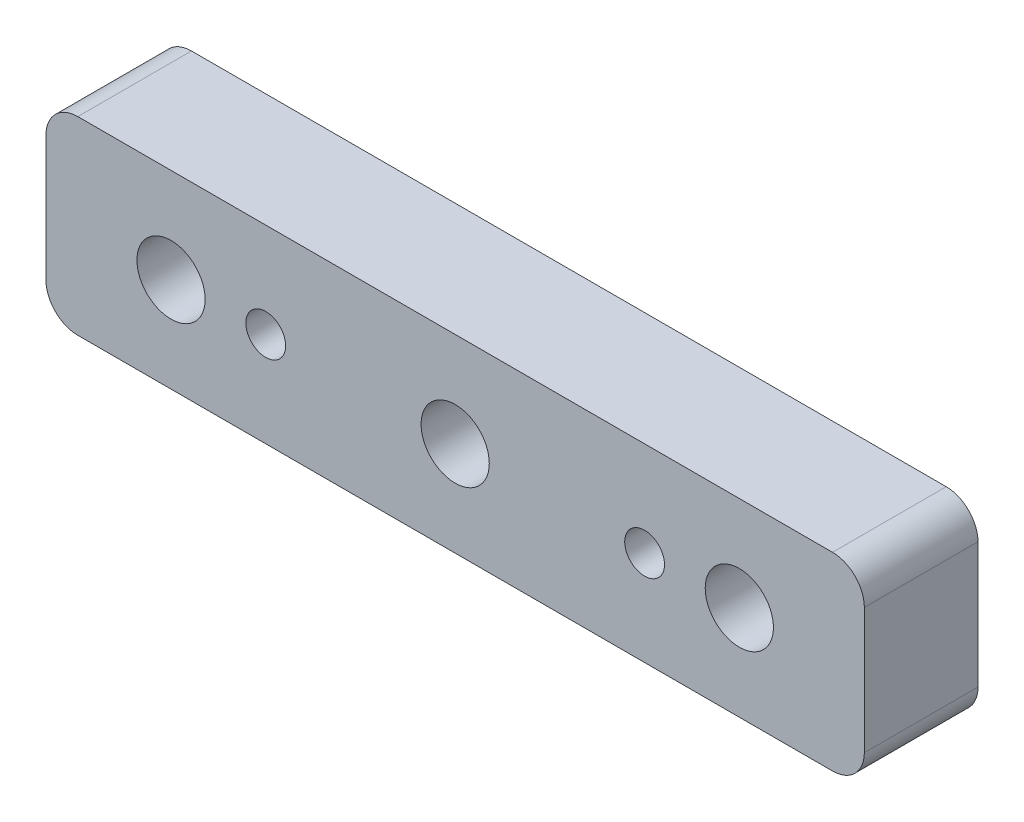
ISO-10303-21;
HEADER;
FILE_DESCRIPTION(('STEP AP214'),'2;1');
FILE_NAME('part.step','',(''),(''),'','','');
FILE_SCHEMA(('AUTOMOTIVE_DESIGN { 1 0 10303 214 1 1 1 1 }'));
ENDSEC;
DATA;
#1=APPLICATION_CONTEXT('core data for automotive mechanical design processes');
#2=APPLICATION_PROTOCOL_DEFINITION('international standard','automotive_design',2000,#1);
#3=PRODUCT_CONTEXT('',#1,'mechanical');
#4=PRODUCT('Part','Part','',(#3));
#5=PRODUCT_RELATED_PRODUCT_CATEGORY('part','',(#4));
#6=PRODUCT_DEFINITION_FORMATION('','',#4);
#7=PRODUCT_DEFINITION_CONTEXT('part definition',#1,'design');
#8=PRODUCT_DEFINITION('design','',#6,#7);
#9=PRODUCT_DEFINITION_SHAPE('','',#8);
#10=(LENGTH_UNIT() NAMED_UNIT(*) SI_UNIT(.MILLI.,.METRE.));
#11=(NAMED_UNIT(*) PLANE_ANGLE_UNIT() SI_UNIT($,.RADIAN.));
#12=(NAMED_UNIT(*) SI_UNIT($,.STERADIAN.) SOLID_ANGLE_UNIT());
#13=UNCERTAINTY_MEASURE_WITH_UNIT(LENGTH_MEASURE(1.E-05),#10,'distance_accuracy_value','');
#14=(GEOMETRIC_REPRESENTATION_CONTEXT(3) GLOBAL_UNCERTAINTY_ASSIGNED_CONTEXT((#13)) GLOBAL_UNIT_ASSIGNED_CONTEXT((#10,
#11,#12)) REPRESENTATION_CONTEXT('',''));
#15=CARTESIAN_POINT('',(0.,0.,0.));
#16=DIRECTION('',(0.,0.,1.));
#17=DIRECTION('',(1.,0.,0.));
#18=AXIS2_PLACEMENT_3D('',#15,#16,#17);
#19=CARTESIAN_POINT('',(39.84,6.64000000000001,12.));
#20=DIRECTION('',(0.,0.,-1.));
#21=DIRECTION('',(-1.,0.,0.));
#22=AXIS2_PLACEMENT_3D('',#19,#20,#21);
#23=CYLINDRICAL_SURFACE('',#22,3.36);
#24=CARTESIAN_POINT('',(39.84,6.64000000000001,0.));
#25=DIRECTION('',(0.,0.,1.));
#26=DIRECTION('',(1.,0.,0.));
#27=AXIS2_PLACEMENT_3D('',#24,#25,#26);
#28=CIRCLE('',#27,3.36);
#29=CARTESIAN_POINT('',(43.2,6.64000000000001,0.));
#30=VERTEX_POINT('',#29);
#31=CARTESIAN_POINT('',(39.84,10.,0.));
#32=VERTEX_POINT('',#31);
#33=EDGE_CURVE('E134',#30,#32,#28,.T.);
#34=ORIENTED_EDGE('',*,*,#33,.T.);
#35=DIRECTION('',(0.,0.,-1.));
#36=VECTOR('',#35,1.);
#37=CARTESIAN_POINT('',(39.84,10.,12.));
#38=LINE('',#37,#36);
#39=CARTESIAN_POINT('',(39.84,10.,12.));
#40=VERTEX_POINT('',#39);
#41=EDGE_CURVE('E11',#40,#32,#38,.T.);
#42=ORIENTED_EDGE('',*,*,#41,.F.);
#43=CARTESIAN_POINT('',(39.84,6.64000000000001,12.));
#44=DIRECTION('',(0.,0.,1.));
#45=DIRECTION('',(1.,0.,0.));
#46=AXIS2_PLACEMENT_3D('',#43,#44,#45);
#47=CIRCLE('',#46,3.36);
#48=CARTESIAN_POINT('',(43.2,6.64000000000001,12.));
#49=VERTEX_POINT('',#48);
#50=EDGE_CURVE('E149',#49,#40,#47,.T.);
#51=ORIENTED_EDGE('',*,*,#50,.F.);
#52=DIRECTION('',(0.,0.,-1.));
#53=VECTOR('',#52,1.);
#54=CARTESIAN_POINT('',(43.2,6.64000000000001,12.));
#55=LINE('',#54,#53);
#56=EDGE_CURVE('E130',#49,#30,#55,.T.);
#57=ORIENTED_EDGE('',*,*,#56,.T.);
#58=EDGE_LOOP('',(#34,#42,#51,#57));
#59=FACE_BOUND('',#58,.T.);
#60=ADVANCED_FACE('F38',(#59),#23,.T.);
#61=CARTESIAN_POINT('',(39.84,10.,12.));
#62=DIRECTION('',(0.,-1.,0.));
#63=DIRECTION('',(1.,0.,0.));
#64=AXIS2_PLACEMENT_3D('',#61,#62,#63);
#65=PLANE('',#64);
#66=DIRECTION('',(-1.,0.,0.));
#67=VECTOR('',#66,1.);
#68=CARTESIAN_POINT('',(39.84,10.,0.));
#69=LINE('',#68,#67);
#70=CARTESIAN_POINT('',(-39.84,9.99999999999999,0.));
#71=VERTEX_POINT('',#70);
#72=EDGE_CURVE('E137',#32,#71,#69,.T.);
#73=ORIENTED_EDGE('',*,*,#72,.T.);
#74=DIRECTION('',(0.,0.,-1.));
#75=VECTOR('',#74,1.);
#76=CARTESIAN_POINT('',(-39.84,9.99999999999999,12.));
#77=LINE('',#76,#75);
#78=CARTESIAN_POINT('',(-39.84,9.99999999999999,12.));
#79=VERTEX_POINT('',#78);
#80=EDGE_CURVE('E46',#79,#71,#77,.T.);
#81=ORIENTED_EDGE('',*,*,#80,.F.);
#82=DIRECTION('',(-1.,0.,0.));
#83=VECTOR('',#82,1.);
#84=CARTESIAN_POINT('',(39.84,10.,12.));
#85=LINE('',#84,#83);
#86=EDGE_CURVE('E97',#40,#79,#85,.T.);
#87=ORIENTED_EDGE('',*,*,#86,.F.);
#88=ORIENTED_EDGE('',*,*,#41,.T.);
#89=EDGE_LOOP('',(#73,#81,#87,#88));
#90=FACE_BOUND('',#89,.T.);
#91=ADVANCED_FACE('F242',(#90),#65,.F.);
#92=CARTESIAN_POINT('',(-39.84,6.64,12.));
#93=DIRECTION('',(0.,0.,-1.));
#94=DIRECTION('',(-1.,0.,0.));
#95=AXIS2_PLACEMENT_3D('',#92,#93,#94);
#96=CYLINDRICAL_SURFACE('',#95,3.36);
#97=CARTESIAN_POINT('',(-39.84,6.64,0.));
#98=DIRECTION('',(0.,0.,1.));
#99=DIRECTION('',(1.,0.,0.));
#100=AXIS2_PLACEMENT_3D('',#97,#98,#99);
#101=CIRCLE('',#100,3.36);
#102=CARTESIAN_POINT('',(-43.2,6.64,0.));
#103=VERTEX_POINT('',#102);
#104=EDGE_CURVE('E140',#71,#103,#101,.T.);
#105=ORIENTED_EDGE('',*,*,#104,.T.);
#106=DIRECTION('',(0.,0.,-1.));
#107=VECTOR('',#106,1.);
#108=CARTESIAN_POINT('',(-43.2,6.64,12.));
#109=LINE('',#108,#107);
#110=CARTESIAN_POINT('',(-43.2,6.64,12.));
#111=VERTEX_POINT('',#110);
#112=EDGE_CURVE('E156',#111,#103,#109,.T.);
#113=ORIENTED_EDGE('',*,*,#112,.F.);
#114=CARTESIAN_POINT('',(-39.84,6.64,12.));
#115=DIRECTION('',(0.,0.,1.));
#116=DIRECTION('',(1.,0.,0.));
#117=AXIS2_PLACEMENT_3D('',#114,#115,#116);
#118=CIRCLE('',#117,3.36);
#119=EDGE_CURVE('E164',#79,#111,#118,.T.);
#120=ORIENTED_EDGE('',*,*,#119,.F.);
#121=ORIENTED_EDGE('',*,*,#80,.T.);
#122=EDGE_LOOP('',(#105,#113,#120,#121));
#123=FACE_BOUND('',#122,.T.);
#124=ADVANCED_FACE('F162',(#123),#96,.T.);
#125=CARTESIAN_POINT('',(-43.2,-6.64,12.));
#126=DIRECTION('',(1.,0.,0.));
#127=DIRECTION('',(0.,0.,-1.));
#128=AXIS2_PLACEMENT_3D('',#125,#126,#127);
#129=PLANE('',#128);
#130=DIRECTION('',(0.,-1.,0.));
#131=VECTOR('',#130,1.);
#132=CARTESIAN_POINT('',(-43.2,-6.64,0.));
#133=LINE('',#132,#131);
#134=CARTESIAN_POINT('',(-43.2,-6.64,0.));
#135=VERTEX_POINT('',#134);
#136=EDGE_CURVE('E142',#103,#135,#133,.T.);
#137=ORIENTED_EDGE('',*,*,#136,.T.);
#138=DIRECTION('',(0.,0.,-1.));
#139=VECTOR('',#138,1.);
#140=CARTESIAN_POINT('',(-43.2,-6.64,12.));
#141=LINE('',#140,#139);
#142=CARTESIAN_POINT('',(-43.2,-6.64,12.));
#143=VERTEX_POINT('',#142);
#144=EDGE_CURVE('E153',#143,#135,#141,.T.);
#145=ORIENTED_EDGE('',*,*,#144,.F.);
#146=DIRECTION('',(0.,-1.,0.));
#147=VECTOR('',#146,1.);
#148=CARTESIAN_POINT('',(-43.2,-6.64,12.));
#149=LINE('',#148,#147);
#150=EDGE_CURVE('E176',#111,#143,#149,.T.);
#151=ORIENTED_EDGE('',*,*,#150,.F.);
#152=ORIENTED_EDGE('',*,*,#112,.T.);
#153=EDGE_LOOP('',(#137,#145,#151,#152));
#154=FACE_BOUND('',#153,.T.);
#155=ADVANCED_FACE('F172',(#154),#129,.F.);
#156=CARTESIAN_POINT('',(-39.84,-6.64,12.));
#157=DIRECTION('',(0.,0.,-1.));
#158=DIRECTION('',(-1.,0.,0.));
#159=AXIS2_PLACEMENT_3D('',#156,#157,#158);
#160=CYLINDRICAL_SURFACE('',#159,3.36);
#161=CARTESIAN_POINT('',(-39.84,-6.64,0.));
#162=DIRECTION('',(0.,0.,1.));
#163=DIRECTION('',(-1.,0.,0.));
#164=AXIS2_PLACEMENT_3D('',#161,#162,#163);
#165=CIRCLE('',#164,3.36);
#166=CARTESIAN_POINT('',(-39.84,-10.,0.));
#167=VERTEX_POINT('',#166);
#168=EDGE_CURVE('E144',#135,#167,#165,.T.);
#169=ORIENTED_EDGE('',*,*,#168,.T.);
#170=DIRECTION('',(0.,0.,-1.));
#171=VECTOR('',#170,1.);
#172=CARTESIAN_POINT('',(-39.84,-10.,12.));
#173=LINE('',#172,#171);
#174=CARTESIAN_POINT('',(-39.84,-10.,12.));
#175=VERTEX_POINT('',#174);
#176=EDGE_CURVE('E125',#175,#167,#173,.T.);
#177=ORIENTED_EDGE('',*,*,#176,.F.);
#178=CARTESIAN_POINT('',(-39.84,-6.64,12.));
#179=DIRECTION('',(0.,0.,1.));
#180=DIRECTION('',(-1.,0.,0.));
#181=AXIS2_PLACEMENT_3D('',#178,#179,#180);
#182=CIRCLE('',#181,3.36);
#183=EDGE_CURVE('E116',#143,#175,#182,.T.);
#184=ORIENTED_EDGE('',*,*,#183,.F.);
#185=ORIENTED_EDGE('',*,*,#144,.T.);
#186=EDGE_LOOP('',(#169,#177,#184,#185));
#187=FACE_BOUND('',#186,.T.);
#188=ADVANCED_FACE('F175',(#187),#160,.T.);
#189=CARTESIAN_POINT('',(39.84,-9.99999999999999,12.));
#190=DIRECTION('',(0.,1.,0.));
#191=DIRECTION('',(-1.,0.,0.));
#192=AXIS2_PLACEMENT_3D('',#189,#190,#191);
#193=PLANE('',#192);
#194=DIRECTION('',(1.,0.,0.));
#195=VECTOR('',#194,1.);
#196=CARTESIAN_POINT('',(39.84,-9.99999999999999,0.));
#197=LINE('',#196,#195);
#198=CARTESIAN_POINT('',(39.84,-9.99999999999999,0.));
#199=VERTEX_POINT('',#198);
#200=EDGE_CURVE('E124',#167,#199,#197,.T.);
#201=ORIENTED_EDGE('',*,*,#200,.T.);
#202=DIRECTION('',(0.,0.,-1.));
#203=VECTOR('',#202,1.);
#204=CARTESIAN_POINT('',(39.84,-9.99999999999999,12.));
#205=LINE('',#204,#203);
#206=CARTESIAN_POINT('',(39.84,-9.99999999999999,12.));
#207=VERTEX_POINT('',#206);
#208=EDGE_CURVE('E121',#207,#199,#205,.T.);
#209=ORIENTED_EDGE('',*,*,#208,.F.);
#210=DIRECTION('',(1.,0.,0.));
#211=VECTOR('',#210,1.);
#212=CARTESIAN_POINT('',(39.84,-9.99999999999999,12.));
#213=LINE('',#212,#211);
#214=EDGE_CURVE('E110',#175,#207,#213,.T.);
#215=ORIENTED_EDGE('',*,*,#214,.F.);
#216=ORIENTED_EDGE('',*,*,#176,.T.);
#217=EDGE_LOOP('',(#201,#209,#215,#216));
#218=FACE_BOUND('',#217,.T.);
#219=ADVANCED_FACE('F122',(#218),#193,.F.);
#220=CARTESIAN_POINT('',(39.84,-6.64,12.));
#221=DIRECTION('',(0.,0.,-1.));
#222=DIRECTION('',(-1.,0.,0.));
#223=AXIS2_PLACEMENT_3D('',#220,#221,#222);
#224=CYLINDRICAL_SURFACE('',#223,3.36);
#225=CARTESIAN_POINT('',(39.84,-6.64,0.));
#226=DIRECTION('',(0.,0.,1.));
#227=DIRECTION('',(1.,0.,0.));
#228=AXIS2_PLACEMENT_3D('',#225,#226,#227);
#229=CIRCLE('',#228,3.36);
#230=CARTESIAN_POINT('',(43.2,-6.64,0.));
#231=VERTEX_POINT('',#230);
#232=EDGE_CURVE('E83',#199,#231,#229,.T.);
#233=ORIENTED_EDGE('',*,*,#232,.T.);
#234=DIRECTION('',(0.,0.,-1.));
#235=VECTOR('',#234,1.);
#236=CARTESIAN_POINT('',(43.2,-6.64,12.));
#237=LINE('',#236,#235);
#238=CARTESIAN_POINT('',(43.2,-6.64,12.));
#239=VERTEX_POINT('',#238);
#240=EDGE_CURVE('E126',#239,#231,#237,.T.);
#241=ORIENTED_EDGE('',*,*,#240,.F.);
#242=CARTESIAN_POINT('',(39.84,-6.64,12.));
#243=DIRECTION('',(0.,0.,1.));
#244=DIRECTION('',(1.,0.,0.));
#245=AXIS2_PLACEMENT_3D('',#242,#243,#244);
#246=CIRCLE('',#245,3.36);
#247=EDGE_CURVE('E114',#207,#239,#246,.T.);
#248=ORIENTED_EDGE('',*,*,#247,.F.);
#249=ORIENTED_EDGE('',*,*,#208,.T.);
#250=EDGE_LOOP('',(#233,#241,#248,#249));
#251=FACE_BOUND('',#250,.T.);
#252=ADVANCED_FACE('F128',(#251),#224,.T.);
#253=CARTESIAN_POINT('',(43.2,-6.64,12.));
#254=DIRECTION('',(-1.,0.,0.));
#255=DIRECTION('',(0.,0.,1.));
#256=AXIS2_PLACEMENT_3D('',#253,#254,#255);
#257=PLANE('',#256);
#258=DIRECTION('',(0.,1.,0.));
#259=VECTOR('',#258,1.);
#260=CARTESIAN_POINT('',(43.2,-6.64,0.));
#261=LINE('',#260,#259);
#262=EDGE_CURVE('E89',#231,#30,#261,.T.);
#263=ORIENTED_EDGE('',*,*,#262,.T.);
#264=ORIENTED_EDGE('',*,*,#56,.F.);
#265=DIRECTION('',(0.,1.,0.));
#266=VECTOR('',#265,1.);
#267=CARTESIAN_POINT('',(43.2,-6.64,12.));
#268=LINE('',#267,#266);
#269=EDGE_CURVE('E54',#239,#49,#268,.T.);
#270=ORIENTED_EDGE('',*,*,#269,.F.);
#271=ORIENTED_EDGE('',*,*,#240,.T.);
#272=EDGE_LOOP('',(#263,#264,#270,#271));
#273=FACE_BOUND('',#272,.T.);
#274=ADVANCED_FACE('F216',(#273),#257,.F.);
#275=CARTESIAN_POINT('',(39.84,6.64000000000001,12.));
#276=DIRECTION('',(0.,0.,1.));
#277=DIRECTION('',(1.,0.,0.));
#278=AXIS2_PLACEMENT_3D('',#275,#276,#277);
#279=PLANE('',#278);
#280=CARTESIAN_POINT('',(-20.,0.,12.));
#281=DIRECTION('',(0.,0.,1.));
#282=DIRECTION('',(1.,0.,0.));
#283=AXIS2_PLACEMENT_3D('',#280,#281,#282);
#284=CIRCLE('',#283,2.09999999999999);
#285=CARTESIAN_POINT('',(-17.9,0.,12.));
#286=VERTEX_POINT('',#285);
#287=EDGE_CURVE('E208',#286,#286,#284,.T.);
#288=ORIENTED_EDGE('',*,*,#287,.F.);
#289=EDGE_LOOP('',(#288));
#290=FACE_BOUND('',#289,.T.);
#291=CARTESIAN_POINT('',(20.,0.,12.));
#292=DIRECTION('',(0.,0.,1.));
#293=DIRECTION('',(1.,0.,0.));
#294=AXIS2_PLACEMENT_3D('',#291,#292,#293);
#295=CIRCLE('',#294,2.09999999999999);
#296=CARTESIAN_POINT('',(22.1,0.,12.));
#297=VERTEX_POINT('',#296);
#298=EDGE_CURVE('E202',#297,#297,#295,.T.);
#299=ORIENTED_EDGE('',*,*,#298,.F.);
#300=EDGE_LOOP('',(#299));
#301=FACE_BOUND('',#300,.T.);
#302=CARTESIAN_POINT('',(30.,0.,12.));
#303=DIRECTION('',(0.,0.,1.));
#304=DIRECTION('',(-1.,0.,0.));
#305=AXIS2_PLACEMENT_3D('',#302,#303,#304);
#306=CIRCLE('',#305,3.6);
#307=CARTESIAN_POINT('',(26.4,0.,12.));
#308=VERTEX_POINT('',#307);
#309=EDGE_CURVE('E194',#308,#308,#306,.T.);
#310=ORIENTED_EDGE('',*,*,#309,.F.);
#311=EDGE_LOOP('',(#310));
#312=FACE_BOUND('',#311,.T.);
#313=CARTESIAN_POINT('',(-30.,0.,12.));
#314=DIRECTION('',(0.,0.,1.));
#315=DIRECTION('',(1.,0.,0.));
#316=AXIS2_PLACEMENT_3D('',#313,#314,#315);
#317=CIRCLE('',#316,3.6);
#318=CARTESIAN_POINT('',(-26.4,0.,12.));
#319=VERTEX_POINT('',#318);
#320=EDGE_CURVE('E188',#319,#319,#317,.T.);
#321=ORIENTED_EDGE('',*,*,#320,.F.);
#322=EDGE_LOOP('',(#321));
#323=FACE_BOUND('',#322,.T.);
#324=CARTESIAN_POINT('',(0.,0.,12.));
#325=DIRECTION('',(0.,0.,1.));
#326=DIRECTION('',(1.,0.,0.));
#327=AXIS2_PLACEMENT_3D('',#324,#325,#326);
#328=CIRCLE('',#327,3.6);
#329=CARTESIAN_POINT('',(3.6,0.,12.));
#330=VERTEX_POINT('',#329);
#331=EDGE_CURVE('E182',#330,#330,#328,.T.);
#332=ORIENTED_EDGE('',*,*,#331,.F.);
#333=EDGE_LOOP('',(#332));
#334=FACE_BOUND('',#333,.T.);
#335=ORIENTED_EDGE('',*,*,#50,.T.);
#336=ORIENTED_EDGE('',*,*,#86,.T.);
#337=ORIENTED_EDGE('',*,*,#119,.T.);
#338=ORIENTED_EDGE('',*,*,#150,.T.);
#339=ORIENTED_EDGE('',*,*,#183,.T.);
#340=ORIENTED_EDGE('',*,*,#214,.T.);
#341=ORIENTED_EDGE('',*,*,#247,.T.);
#342=ORIENTED_EDGE('',*,*,#269,.T.);
#343=EDGE_LOOP('',(#335,#336,#337,#338,#339,#340,#341,#342));
#344=FACE_BOUND('',#343,.T.);
#345=ADVANCED_FACE('F112',(#290,#301,#312,#323,#334,#344),#279,.T.);
#346=CARTESIAN_POINT('',(39.84,6.64000000000001,0.));
#347=DIRECTION('',(0.,0.,1.));
#348=DIRECTION('',(1.,0.,0.));
#349=AXIS2_PLACEMENT_3D('',#346,#347,#348);
#350=PLANE('',#349);
#351=CARTESIAN_POINT('',(-20.,0.,0.));
#352=DIRECTION('',(0.,0.,1.));
#353=DIRECTION('',(1.,0.,0.));
#354=AXIS2_PLACEMENT_3D('',#351,#352,#353);
#355=CIRCLE('',#354,2.1);
#356=CARTESIAN_POINT('',(-17.9,0.,0.));
#357=VERTEX_POINT('',#356);
#358=EDGE_CURVE('E205',#357,#357,#355,.T.);
#359=ORIENTED_EDGE('',*,*,#358,.T.);
#360=EDGE_LOOP('',(#359));
#361=FACE_BOUND('',#360,.T.);
#362=CARTESIAN_POINT('',(20.,0.,0.));
#363=DIRECTION('',(0.,0.,1.));
#364=DIRECTION('',(1.,0.,0.));
#365=AXIS2_PLACEMENT_3D('',#362,#363,#364);
#366=CIRCLE('',#365,2.1);
#367=CARTESIAN_POINT('',(22.1,0.,0.));
#368=VERTEX_POINT('',#367);
#369=EDGE_CURVE('E197',#368,#368,#366,.T.);
#370=ORIENTED_EDGE('',*,*,#369,.T.);
#371=EDGE_LOOP('',(#370));
#372=FACE_BOUND('',#371,.T.);
#373=CARTESIAN_POINT('',(30.,0.,0.));
#374=DIRECTION('',(0.,0.,1.));
#375=DIRECTION('',(-1.,0.,0.));
#376=AXIS2_PLACEMENT_3D('',#373,#374,#375);
#377=CIRCLE('',#376,3.6);
#378=CARTESIAN_POINT('',(26.4,0.,0.));
#379=VERTEX_POINT('',#378);
#380=EDGE_CURVE('E191',#379,#379,#377,.T.);
#381=ORIENTED_EDGE('',*,*,#380,.T.);
#382=EDGE_LOOP('',(#381));
#383=FACE_BOUND('',#382,.T.);
#384=CARTESIAN_POINT('',(-30.,0.,0.));
#385=DIRECTION('',(0.,0.,1.));
#386=DIRECTION('',(1.,0.,0.));
#387=AXIS2_PLACEMENT_3D('',#384,#385,#386);
#388=CIRCLE('',#387,3.6);
#389=CARTESIAN_POINT('',(-26.4,0.,0.));
#390=VERTEX_POINT('',#389);
#391=EDGE_CURVE('E185',#390,#390,#388,.T.);
#392=ORIENTED_EDGE('',*,*,#391,.T.);
#393=EDGE_LOOP('',(#392));
#394=FACE_BOUND('',#393,.T.);
#395=CARTESIAN_POINT('',(0.,0.,0.));
#396=DIRECTION('',(0.,0.,1.));
#397=DIRECTION('',(1.,0.,0.));
#398=AXIS2_PLACEMENT_3D('',#395,#396,#397);
#399=CIRCLE('',#398,3.6);
#400=CARTESIAN_POINT('',(3.6,0.,0.));
#401=VERTEX_POINT('',#400);
#402=EDGE_CURVE('E138',#401,#401,#399,.T.);
#403=ORIENTED_EDGE('',*,*,#402,.T.);
#404=EDGE_LOOP('',(#403));
#405=FACE_BOUND('',#404,.T.);
#406=ORIENTED_EDGE('',*,*,#33,.F.);
#407=ORIENTED_EDGE('',*,*,#262,.F.);
#408=ORIENTED_EDGE('',*,*,#232,.F.);
#409=ORIENTED_EDGE('',*,*,#200,.F.);
#410=ORIENTED_EDGE('',*,*,#168,.F.);
#411=ORIENTED_EDGE('',*,*,#136,.F.);
#412=ORIENTED_EDGE('',*,*,#104,.F.);
#413=ORIENTED_EDGE('',*,*,#72,.F.);
#414=EDGE_LOOP('',(#406,#407,#408,#409,#410,#411,#412,#413));
#415=FACE_BOUND('',#414,.T.);
#416=ADVANCED_FACE('F168',(#361,#372,#383,#394,#405,#415),#350,.F.);
#417=CARTESIAN_POINT('',(0.,0.,0.));
#418=DIRECTION('',(0.,0.,1.));
#419=DIRECTION('',(1.,0.,0.));
#420=AXIS2_PLACEMENT_3D('',#417,#418,#419);
#421=CYLINDRICAL_SURFACE('',#420,3.6);
#422=ORIENTED_EDGE('',*,*,#402,.F.);
#423=EDGE_LOOP('',(#422));
#424=FACE_BOUND('',#423,.T.);
#425=ORIENTED_EDGE('',*,*,#331,.T.);
#426=EDGE_LOOP('',(#425));
#427=FACE_BOUND('',#426,.T.);
#428=ADVANCED_FACE('F226',(#424,#427),#421,.F.);
#429=CARTESIAN_POINT('',(-30.,0.,0.));
#430=DIRECTION('',(0.,0.,1.));
#431=DIRECTION('',(1.,0.,0.));
#432=AXIS2_PLACEMENT_3D('',#429,#430,#431);
#433=CYLINDRICAL_SURFACE('',#432,3.6);
#434=ORIENTED_EDGE('',*,*,#391,.F.);
#435=EDGE_LOOP('',(#434));
#436=FACE_BOUND('',#435,.T.);
#437=ORIENTED_EDGE('',*,*,#320,.T.);
#438=EDGE_LOOP('',(#437));
#439=FACE_BOUND('',#438,.T.);
#440=ADVANCED_FACE('F228',(#436,#439),#433,.F.);
#441=CARTESIAN_POINT('',(30.,0.,0.));
#442=DIRECTION('',(0.,0.,1.));
#443=DIRECTION('',(1.,0.,0.));
#444=AXIS2_PLACEMENT_3D('',#441,#442,#443);
#445=CYLINDRICAL_SURFACE('',#444,3.6);
#446=ORIENTED_EDGE('',*,*,#380,.F.);
#447=EDGE_LOOP('',(#446));
#448=FACE_BOUND('',#447,.T.);
#449=ORIENTED_EDGE('',*,*,#309,.T.);
#450=EDGE_LOOP('',(#449));
#451=FACE_BOUND('',#450,.T.);
#452=ADVANCED_FACE('F235',(#448,#451),#445,.F.);
#453=CARTESIAN_POINT('',(20.,0.,12.));
#454=DIRECTION('',(0.,0.,1.));
#455=DIRECTION('',(1.,0.,0.));
#456=AXIS2_PLACEMENT_3D('',#453,#454,#455);
#457=CYLINDRICAL_SURFACE('',#456,2.09999999999999);
#458=ORIENTED_EDGE('',*,*,#369,.F.);
#459=EDGE_LOOP('',(#458));
#460=FACE_BOUND('',#459,.T.);
#461=ORIENTED_EDGE('',*,*,#298,.T.);
#462=EDGE_LOOP('',(#461));
#463=FACE_BOUND('',#462,.T.);
#464=ADVANCED_FACE('F287',(#460,#463),#457,.F.);
#465=CARTESIAN_POINT('',(-20.,0.,12.));
#466=DIRECTION('',(0.,0.,1.));
#467=DIRECTION('',(1.,0.,0.));
#468=AXIS2_PLACEMENT_3D('',#465,#466,#467);
#469=CYLINDRICAL_SURFACE('',#468,2.09999999999999);
#470=ORIENTED_EDGE('',*,*,#358,.F.);
#471=EDGE_LOOP('',(#470));
#472=FACE_BOUND('',#471,.T.);
#473=ORIENTED_EDGE('',*,*,#287,.T.);
#474=EDGE_LOOP('',(#473));
#475=FACE_BOUND('',#474,.T.);
#476=ADVANCED_FACE('F212',(#472,#475),#469,.F.);
#477=CLOSED_SHELL('',(#60,#91,#124,#155,#188,#219,#252,#274,#345,#416,#428,#440,#452,#464,#476));
#478=MANIFOLD_SOLID_BREP('B2',#477);
#479=ADVANCED_BREP_SHAPE_REPRESENTATION('',(#18,#478),#14);
#480=SHAPE_DEFINITION_REPRESENTATION(#9,#479);
ENDSEC;
END-ISO-10303-21;
